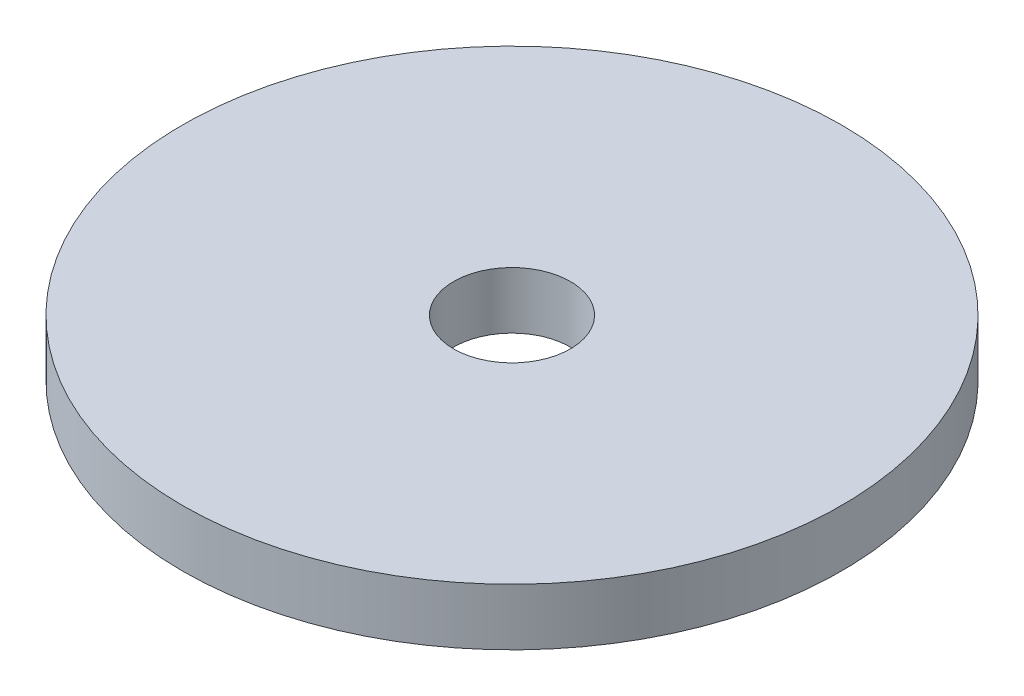
ISO-10303-21;
HEADER;
FILE_DESCRIPTION(('STEP AP214'),'2;1');
FILE_NAME('part.step','',(''),(''),'','','');
FILE_SCHEMA(('AUTOMOTIVE_DESIGN { 1 0 10303 214 1 1 1 1 }'));
ENDSEC;
DATA;
#1=APPLICATION_CONTEXT('core data for automotive mechanical design processes');
#2=APPLICATION_PROTOCOL_DEFINITION('international standard','automotive_design',2000,#1);
#3=PRODUCT_CONTEXT('',#1,'mechanical');
#4=PRODUCT('Part','Part','',(#3));
#5=PRODUCT_RELATED_PRODUCT_CATEGORY('part','',(#4));
#6=PRODUCT_DEFINITION_FORMATION('','',#4);
#7=PRODUCT_DEFINITION_CONTEXT('part definition',#1,'design');
#8=PRODUCT_DEFINITION('design','',#6,#7);
#9=PRODUCT_DEFINITION_SHAPE('','',#8);
#10=(LENGTH_UNIT() NAMED_UNIT(*) SI_UNIT(.MILLI.,.METRE.));
#11=(NAMED_UNIT(*) PLANE_ANGLE_UNIT() SI_UNIT($,.RADIAN.));
#12=(NAMED_UNIT(*) SI_UNIT($,.STERADIAN.) SOLID_ANGLE_UNIT());
#13=UNCERTAINTY_MEASURE_WITH_UNIT(LENGTH_MEASURE(1.E-05),#10,'distance_accuracy_value','');
#14=(GEOMETRIC_REPRESENTATION_CONTEXT(3) GLOBAL_UNCERTAINTY_ASSIGNED_CONTEXT((#13)) GLOBAL_UNIT_ASSIGNED_CONTEXT((#10,
#11,#12)) REPRESENTATION_CONTEXT('',''));
#15=CARTESIAN_POINT('',(0.,0.,0.));
#16=DIRECTION('',(0.,0.,1.));
#17=DIRECTION('',(1.,0.,0.));
#18=AXIS2_PLACEMENT_3D('',#15,#16,#17);
#19=CARTESIAN_POINT('',(0.,3.175,0.));
#20=DIRECTION('',(0.,-1.,0.));
#21=DIRECTION('',(0.,0.,-1.));
#22=AXIS2_PLACEMENT_3D('',#19,#20,#21);
#23=CYLINDRICAL_SURFACE('',#22,18.415);
#24=CARTESIAN_POINT('',(0.,3.175,0.));
#25=DIRECTION('',(0.,1.,0.));
#26=DIRECTION('',(0.,0.,1.));
#27=AXIS2_PLACEMENT_3D('',#24,#25,#26);
#28=CIRCLE('',#27,18.415);
#29=CARTESIAN_POINT('',(0.,3.175,18.415));
#30=VERTEX_POINT('',#29);
#31=EDGE_CURVE('E10',#30,#30,#28,.T.);
#32=ORIENTED_EDGE('',*,*,#31,.F.);
#33=EDGE_LOOP('',(#32));
#34=FACE_BOUND('',#33,.T.);
#35=CARTESIAN_POINT('',(0.,0.,0.));
#36=DIRECTION('',(0.,1.,0.));
#37=DIRECTION('',(0.,0.,1.));
#38=AXIS2_PLACEMENT_3D('',#35,#36,#37);
#39=CIRCLE('',#38,18.415);
#40=CARTESIAN_POINT('',(0.,0.,18.415));
#41=VERTEX_POINT('',#40);
#42=EDGE_CURVE('E44',#41,#41,#39,.T.);
#43=ORIENTED_EDGE('',*,*,#42,.T.);
#44=EDGE_LOOP('',(#43));
#45=FACE_BOUND('',#44,.T.);
#46=ADVANCED_FACE('F37',(#34,#45),#23,.T.);
#47=CARTESIAN_POINT('',(0.,3.175,0.));
#48=DIRECTION('',(0.,1.,0.));
#49=DIRECTION('',(0.,0.,1.));
#50=AXIS2_PLACEMENT_3D('',#47,#48,#49);
#51=PLANE('',#50);
#52=CARTESIAN_POINT('',(0.,3.175,0.));
#53=DIRECTION('',(0.,1.,0.));
#54=DIRECTION('',(0.,0.,1.));
#55=AXIS2_PLACEMENT_3D('',#52,#53,#54);
#56=CIRCLE('',#55,3.2639);
#57=CARTESIAN_POINT('',(0.,3.175,3.2639));
#58=VERTEX_POINT('',#57);
#59=EDGE_CURVE('E50',#58,#58,#56,.T.);
#60=ORIENTED_EDGE('',*,*,#59,.F.);
#61=EDGE_LOOP('',(#60));
#62=FACE_BOUND('',#61,.T.);
#63=ORIENTED_EDGE('',*,*,#31,.T.);
#64=EDGE_LOOP('',(#63));
#65=FACE_BOUND('',#64,.T.);
#66=ADVANCED_FACE('F66',(#62,#65),#51,.T.);
#67=CARTESIAN_POINT('',(0.,0.,0.));
#68=DIRECTION('',(0.,1.,0.));
#69=DIRECTION('',(0.,0.,1.));
#70=AXIS2_PLACEMENT_3D('',#67,#68,#69);
#71=PLANE('',#70);
#72=CARTESIAN_POINT('',(0.,0.,0.));
#73=DIRECTION('',(0.,1.,0.));
#74=DIRECTION('',(0.,0.,1.));
#75=AXIS2_PLACEMENT_3D('',#72,#73,#74);
#76=CIRCLE('',#75,3.2639);
#77=CARTESIAN_POINT('',(0.,0.,3.2639));
#78=VERTEX_POINT('',#77);
#79=EDGE_CURVE('E40',#78,#78,#76,.T.);
#80=ORIENTED_EDGE('',*,*,#79,.T.);
#81=EDGE_LOOP('',(#80));
#82=FACE_BOUND('',#81,.T.);
#83=ORIENTED_EDGE('',*,*,#42,.F.);
#84=EDGE_LOOP('',(#83));
#85=FACE_BOUND('',#84,.T.);
#86=ADVANCED_FACE('F57',(#82,#85),#71,.F.);
#87=CARTESIAN_POINT('',(0.,3.175,0.));
#88=DIRECTION('',(0.,1.,0.));
#89=DIRECTION('',(0.,0.,1.));
#90=AXIS2_PLACEMENT_3D('',#87,#88,#89);
#91=CYLINDRICAL_SURFACE('',#90,3.2639);
#92=ORIENTED_EDGE('',*,*,#59,.T.);
#93=EDGE_LOOP('',(#92));
#94=FACE_BOUND('',#93,.T.);
#95=ORIENTED_EDGE('',*,*,#79,.F.);
#96=EDGE_LOOP('',(#95));
#97=FACE_BOUND('',#96,.T.);
#98=ADVANCED_FACE('F60',(#94,#97),#91,.F.);
#99=CLOSED_SHELL('',(#46,#66,#86,#98));
#100=MANIFOLD_SOLID_BREP('B2',#99);
#101=ADVANCED_BREP_SHAPE_REPRESENTATION('',(#18,#100),#14);
#102=SHAPE_DEFINITION_REPRESENTATION(#9,#101);
ENDSEC;
END-ISO-10303-21;
